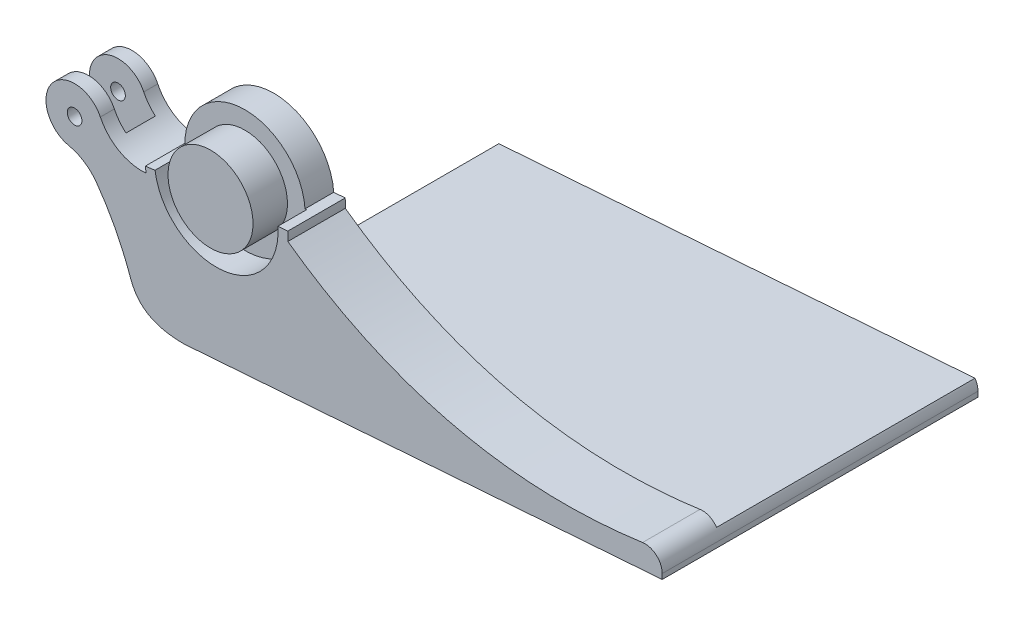
ISO-10303-21;
HEADER;
FILE_DESCRIPTION(('STEP AP214'),'2;1');
FILE_NAME('part.step','',(''),(''),'','','');
FILE_SCHEMA(('AUTOMOTIVE_DESIGN { 1 0 10303 214 1 1 1 1 }'));
ENDSEC;
DATA;
#1=APPLICATION_CONTEXT('core data for automotive mechanical design processes');
#2=APPLICATION_PROTOCOL_DEFINITION('international standard','automotive_design',2000,#1);
#3=PRODUCT_CONTEXT('',#1,'mechanical');
#4=PRODUCT('Part','Part','',(#3));
#5=PRODUCT_RELATED_PRODUCT_CATEGORY('part','',(#4));
#6=PRODUCT_DEFINITION_FORMATION('','',#4);
#7=PRODUCT_DEFINITION_CONTEXT('part definition',#1,'design');
#8=PRODUCT_DEFINITION('design','',#6,#7);
#9=PRODUCT_DEFINITION_SHAPE('','',#8);
#10=(LENGTH_UNIT() NAMED_UNIT(*) SI_UNIT(.MILLI.,.METRE.));
#11=(NAMED_UNIT(*) PLANE_ANGLE_UNIT() SI_UNIT($,.RADIAN.));
#12=(NAMED_UNIT(*) SI_UNIT($,.STERADIAN.) SOLID_ANGLE_UNIT());
#13=UNCERTAINTY_MEASURE_WITH_UNIT(LENGTH_MEASURE(1.E-05),#10,'distance_accuracy_value','');
#14=(GEOMETRIC_REPRESENTATION_CONTEXT(3) GLOBAL_UNCERTAINTY_ASSIGNED_CONTEXT((#13)) GLOBAL_UNIT_ASSIGNED_CONTEXT((#10,
#11,#12)) REPRESENTATION_CONTEXT('',''));
#15=CARTESIAN_POINT('',(0.,0.,0.));
#16=DIRECTION('',(0.,0.,1.));
#17=DIRECTION('',(1.,0.,0.));
#18=AXIS2_PLACEMENT_3D('',#15,#16,#17);
#19=CARTESIAN_POINT('',(-62.6708512351037,-408.288415220356,-61.1876777576715));
#20=DIRECTION('',(0.,0.,1.));
#21=DIRECTION('',(1.,0.,0.));
#22=AXIS2_PLACEMENT_3D('',#19,#20,#21);
#23=CYLINDRICAL_SURFACE('',#22,12.6528548126842);
#24=DIRECTION('',(0.,0.,1.));
#25=VECTOR('',#24,1.);
#26=CARTESIAN_POINT('',(-51.2833585505194,-402.773005419679,-61.1876777576715));
#27=LINE('',#26,#25);
#28=CARTESIAN_POINT('',(-51.2833585505194,-402.773005419679,0.));
#29=VERTEX_POINT('',#28);
#30=CARTESIAN_POINT('',(-51.2833585505194,-402.773005419679,-6.19327650990498));
#31=VERTEX_POINT('',#30);
#32=EDGE_CURVE('E316',#29,#31,#27,.F.);
#33=ORIENTED_EDGE('',*,*,#32,.T.);
#34=CARTESIAN_POINT('',(-62.6708512351037,-408.288415220356,-6.19327650990498));
#35=DIRECTION('',(0.,0.,-1.));
#36=DIRECTION('',(0.,1.,0.));
#37=AXIS2_PLACEMENT_3D('',#34,#35,#36);
#38=CIRCLE('',#37,12.6528548126842);
#39=CARTESIAN_POINT('',(-65.2956830154994,-420.666015675836,-6.19327650990498));
#40=VERTEX_POINT('',#39);
#41=EDGE_CURVE('E227',#31,#40,#38,.F.);
#42=ORIENTED_EDGE('',*,*,#41,.T.);
#43=DIRECTION('',(0.,0.,1.));
#44=VECTOR('',#43,1.);
#45=CARTESIAN_POINT('',(-65.2956830154994,-420.666015675836,-61.1876777576715));
#46=LINE('',#45,#44);
#47=CARTESIAN_POINT('',(-65.2956830154994,-420.666015675836,0.));
#48=VERTEX_POINT('',#47);
#49=EDGE_CURVE('E319',#40,#48,#46,.T.);
#50=ORIENTED_EDGE('',*,*,#49,.T.);
#51=CARTESIAN_POINT('',(-62.6708512351037,-408.288415220356,0.));
#52=DIRECTION('',(0.,0.,1.));
#53=DIRECTION('',(1.,0.,0.));
#54=AXIS2_PLACEMENT_3D('',#51,#52,#53);
#55=CIRCLE('',#54,12.6528548126842);
#56=EDGE_CURVE('E265',#29,#48,#55,.T.);
#57=ORIENTED_EDGE('',*,*,#56,.F.);
#58=EDGE_LOOP('',(#33,#42,#50,#57));
#59=FACE_BOUND('',#58,.T.);
#60=ADVANCED_FACE('F35',(#59),#23,.T.);
#61=CARTESIAN_POINT('',(-65.2956830154994,-420.666015675836,-25.4));
#62=VERTEX_POINT('',#61);
#63=CARTESIAN_POINT('',(-65.2956830154994,-420.666015675836,-19.206723490095));
#64=VERTEX_POINT('',#63);
#65=EDGE_CURVE('E286',#62,#64,#46,.T.);
#66=ORIENTED_EDGE('',*,*,#65,.T.);
#67=CARTESIAN_POINT('',(-62.6708512351037,-408.288415220356,-19.206723490095));
#68=DIRECTION('',(0.,0.,1.));
#69=DIRECTION('',(1.,0.,0.));
#70=AXIS2_PLACEMENT_3D('',#67,#68,#69);
#71=CIRCLE('',#70,12.6528548126842);
#72=CARTESIAN_POINT('',(-51.2833585505194,-402.773005419679,-19.206723490095));
#73=VERTEX_POINT('',#72);
#74=EDGE_CURVE('E214',#64,#73,#71,.F.);
#75=ORIENTED_EDGE('',*,*,#74,.T.);
#76=CARTESIAN_POINT('',(-51.2833585505194,-402.773005419679,-25.4));
#77=VERTEX_POINT('',#76);
#78=EDGE_CURVE('E311',#73,#77,#27,.F.);
#79=ORIENTED_EDGE('',*,*,#78,.T.);
#80=CARTESIAN_POINT('',(-62.6708512351037,-408.288415220356,-25.4));
#81=DIRECTION('',(0.,0.,-1.));
#82=DIRECTION('',(-1.,0.,0.));
#83=AXIS2_PLACEMENT_3D('',#80,#81,#82);
#84=CIRCLE('',#83,12.6528548126842);
#85=EDGE_CURVE('E268',#77,#62,#84,.F.);
#86=ORIENTED_EDGE('',*,*,#85,.T.);
#87=EDGE_LOOP('',(#66,#75,#79,#86));
#88=FACE_BOUND('',#87,.T.);
#89=ADVANCED_FACE('F310',(#88),#23,.T.);
#90=CARTESIAN_POINT('',(-62.6708512351037,-408.288415220356,-25.4000250000001));
#91=DIRECTION('',(0.,0.,1.));
#92=DIRECTION('',(1.,0.,0.));
#93=AXIS2_PLACEMENT_3D('',#90,#91,#92);
#94=CYLINDRICAL_SURFACE('',#93,3.25000000134294);
#95=CARTESIAN_POINT('',(-62.6708512351037,-408.288415220356,0.));
#96=DIRECTION('',(0.,0.,1.));
#97=DIRECTION('',(1.,0.,0.));
#98=AXIS2_PLACEMENT_3D('',#95,#96,#97);
#99=CIRCLE('',#98,3.25000000134294);
#100=CARTESIAN_POINT('',(-59.4208512337607,-408.288415220356,0.));
#101=VERTEX_POINT('',#100);
#102=EDGE_CURVE('E261',#101,#101,#99,.T.);
#103=ORIENTED_EDGE('',*,*,#102,.T.);
#104=EDGE_LOOP('',(#103));
#105=FACE_BOUND('',#104,.T.);
#106=CARTESIAN_POINT('',(-62.6708512351037,-408.288415220356,-6.19327650990498));
#107=DIRECTION('',(0.,0.,-1.));
#108=DIRECTION('',(0.,1.,0.));
#109=AXIS2_PLACEMENT_3D('',#106,#107,#108);
#110=CIRCLE('',#109,3.25000000134294);
#111=CARTESIAN_POINT('',(-62.6708512351037,-405.038415219013,-6.19327650990498));
#112=VERTEX_POINT('',#111);
#113=EDGE_CURVE('E232',#112,#112,#110,.F.);
#114=ORIENTED_EDGE('',*,*,#113,.F.);
#115=EDGE_LOOP('',(#114));
#116=FACE_BOUND('',#115,.T.);
#117=ADVANCED_FACE('F582',(#105,#116),#94,.F.);
#118=CARTESIAN_POINT('',(-62.6708512351037,-408.288415220356,-25.4));
#119=DIRECTION('',(0.,0.,-1.));
#120=DIRECTION('',(-1.,0.,0.));
#121=AXIS2_PLACEMENT_3D('',#118,#119,#120);
#122=CIRCLE('',#121,3.25000000134294);
#123=CARTESIAN_POINT('',(-65.9208512364466,-408.288415220356,-25.4));
#124=VERTEX_POINT('',#123);
#125=EDGE_CURVE('E264',#124,#124,#122,.T.);
#126=ORIENTED_EDGE('',*,*,#125,.T.);
#127=EDGE_LOOP('',(#126));
#128=FACE_BOUND('',#127,.T.);
#129=CARTESIAN_POINT('',(-62.6708512351037,-408.288415220356,-19.206723490095));
#130=DIRECTION('',(0.,0.,1.));
#131=DIRECTION('',(1.,0.,0.));
#132=AXIS2_PLACEMENT_3D('',#129,#130,#131);
#133=CIRCLE('',#132,3.25000000134294);
#134=CARTESIAN_POINT('',(-59.4208512337607,-408.288415220356,-19.206723490095));
#135=VERTEX_POINT('',#134);
#136=EDGE_CURVE('E224',#135,#135,#133,.F.);
#137=ORIENTED_EDGE('',*,*,#136,.F.);
#138=EDGE_LOOP('',(#137));
#139=FACE_BOUND('',#138,.T.);
#140=ADVANCED_FACE('F586',(#128,#139),#94,.F.);
#141=CARTESIAN_POINT('',(-69.5110622771164,-440.543967725298,-12.7));
#142=DIRECTION('',(0.,0.,1.));
#143=DIRECTION('',(1.,0.,0.));
#144=AXIS2_PLACEMENT_3D('',#141,#142,#143);
#145=CYLINDRICAL_SURFACE('',#144,20.32);
#146=CARTESIAN_POINT('',(-69.5110622771164,-440.543967725298,-6.19327650990498));
#147=DIRECTION('',(0.,0.,-1.));
#148=DIRECTION('',(0.,1.,0.));
#149=AXIS2_PLACEMENT_3D('',#146,#147,#148);
#150=CIRCLE('',#149,20.32);
#151=CARTESIAN_POINT('',(-59.137076034932,-423.071623593873,-6.19327650990498));
#152=VERTEX_POINT('',#151);
#153=EDGE_CURVE('E230',#152,#40,#150,.F.);
#154=ORIENTED_EDGE('',*,*,#153,.F.);
#155=DIRECTION('',(0.,0.,1.));
#156=VECTOR('',#155,1.);
#157=CARTESIAN_POINT('',(-59.137076034932,-423.071623593873,-12.7));
#158=LINE('',#157,#156);
#159=CARTESIAN_POINT('',(-59.137076034932,-423.071623593873,-19.206723490095));
#160=VERTEX_POINT('',#159);
#161=EDGE_CURVE('E11',#160,#152,#158,.T.);
#162=ORIENTED_EDGE('',*,*,#161,.F.);
#163=CARTESIAN_POINT('',(-69.5110622771164,-440.543967725298,-19.206723490095));
#164=DIRECTION('',(0.,0.,1.));
#165=DIRECTION('',(1.,0.,0.));
#166=AXIS2_PLACEMENT_3D('',#163,#164,#165);
#167=CIRCLE('',#166,20.32);
#168=EDGE_CURVE('E218',#64,#160,#167,.F.);
#169=ORIENTED_EDGE('',*,*,#168,.F.);
#170=ORIENTED_EDGE('',*,*,#65,.F.);
#171=CARTESIAN_POINT('',(-69.5110622771164,-440.543967725298,-25.4));
#172=DIRECTION('',(0.,0.,-1.));
#173=DIRECTION('',(-1.,0.,0.));
#174=AXIS2_PLACEMENT_3D('',#171,#172,#173);
#175=CIRCLE('',#174,20.32);
#176=CARTESIAN_POINT('',(-53.0342644858855,-428.652057258646,-25.4));
#177=VERTEX_POINT('',#176);
#178=EDGE_CURVE('E292',#177,#62,#175,.F.);
#179=ORIENTED_EDGE('',*,*,#178,.F.);
#180=DIRECTION('',(0.,0.,1.));
#181=VECTOR('',#180,1.);
#182=CARTESIAN_POINT('',(-53.0342644858856,-428.652057258646,0.));
#183=LINE('',#182,#181);
#184=CARTESIAN_POINT('',(-53.0342644858856,-428.652057258646,0.));
#185=VERTEX_POINT('',#184);
#186=EDGE_CURVE('E288',#185,#177,#183,.F.);
#187=ORIENTED_EDGE('',*,*,#186,.F.);
#188=CARTESIAN_POINT('',(-69.5110622771164,-440.543967725298,0.));
#189=DIRECTION('',(0.,0.,1.));
#190=DIRECTION('',(1.,0.,0.));
#191=AXIS2_PLACEMENT_3D('',#188,#189,#190);
#192=CIRCLE('',#191,20.32);
#193=EDGE_CURVE('E290',#48,#185,#192,.F.);
#194=ORIENTED_EDGE('',*,*,#193,.F.);
#195=ORIENTED_EDGE('',*,*,#49,.F.);
#196=EDGE_LOOP('',(#154,#162,#169,#170,#179,#187,#194,#195));
#197=FACE_BOUND('',#196,.T.);
#198=ADVANCED_FACE('F520',(#197),#145,.F.);
#199=CARTESIAN_POINT('',(-32.9954816423939,-393.915468617992,-12.7));
#200=DIRECTION('',(0.,0.,1.));
#201=DIRECTION('',(1.,0.,0.));
#202=AXIS2_PLACEMENT_3D('',#199,#200,#201);
#203=CYLINDRICAL_SURFACE('',#202,20.32);
#204=CARTESIAN_POINT('',(-32.9954816423939,-393.915468617992,-6.19327650990498));
#205=DIRECTION('',(0.,0.,-1.));
#206=DIRECTION('',(0.,1.,0.));
#207=AXIS2_PLACEMENT_3D('',#204,#205,#206);
#208=CIRCLE('',#207,20.32);
#209=CARTESIAN_POINT('',(-46.1342496053724,-409.416280739136,-6.19327650990498));
#210=VERTEX_POINT('',#209);
#211=EDGE_CURVE('E43',#31,#210,#208,.F.);
#212=ORIENTED_EDGE('',*,*,#211,.F.);
#213=ORIENTED_EDGE('',*,*,#32,.F.);
#214=CARTESIAN_POINT('',(-32.9954816423939,-393.915468617992,0.));
#215=DIRECTION('',(0.,0.,1.));
#216=DIRECTION('',(1.,0.,0.));
#217=AXIS2_PLACEMENT_3D('',#214,#215,#216);
#218=CIRCLE('',#217,20.32);
#219=CARTESIAN_POINT('',(-30.9682303902719,-414.134090043815,0.));
#220=VERTEX_POINT('',#219);
#221=EDGE_CURVE('E296',#220,#29,#218,.F.);
#222=ORIENTED_EDGE('',*,*,#221,.F.);
#223=DIRECTION('',(0.,0.,-1.));
#224=VECTOR('',#223,1.);
#225=CARTESIAN_POINT('',(-30.9682303902719,-414.134090043815,-12.7));
#226=LINE('',#225,#224);
#227=CARTESIAN_POINT('',(-30.9682303902719,-414.134090043815,-25.4));
#228=VERTEX_POINT('',#227);
#229=EDGE_CURVE('E400',#220,#228,#226,.T.);
#230=ORIENTED_EDGE('',*,*,#229,.T.);
#231=CARTESIAN_POINT('',(-32.9954816423939,-393.915468617992,-25.4));
#232=DIRECTION('',(0.,0.,-1.));
#233=DIRECTION('',(-1.,0.,0.));
#234=AXIS2_PLACEMENT_3D('',#231,#232,#233);
#235=CIRCLE('',#234,20.32);
#236=EDGE_CURVE('E294',#77,#228,#235,.F.);
#237=ORIENTED_EDGE('',*,*,#236,.F.);
#238=ORIENTED_EDGE('',*,*,#78,.F.);
#239=CARTESIAN_POINT('',(-32.9954816423939,-393.915468617992,-19.206723490095));
#240=DIRECTION('',(0.,0.,1.));
#241=DIRECTION('',(1.,0.,0.));
#242=AXIS2_PLACEMENT_3D('',#239,#240,#241);
#243=CIRCLE('',#242,20.32);
#244=CARTESIAN_POINT('',(-46.1342496053724,-409.416280739136,-19.206723490095));
#245=VERTEX_POINT('',#244);
#246=EDGE_CURVE('E300',#245,#73,#243,.F.);
#247=ORIENTED_EDGE('',*,*,#246,.F.);
#248=DIRECTION('',(0.,0.,1.));
#249=VECTOR('',#248,1.);
#250=CARTESIAN_POINT('',(-46.1342496053724,-409.416280739136,-12.7));
#251=LINE('',#250,#249);
#252=EDGE_CURVE('E298',#210,#245,#251,.F.);
#253=ORIENTED_EDGE('',*,*,#252,.F.);
#254=EDGE_LOOP('',(#212,#213,#222,#230,#237,#238,#247,#253));
#255=FACE_BOUND('',#254,.T.);
#256=ADVANCED_FACE('F37',(#255),#203,.F.);
#257=CARTESIAN_POINT('',(-14.2133467217654,-471.208070579211,-12.7));
#258=CARTESIAN_POINT('',(-31.6860440554397,-471.208070579211,-12.7));
#259=CARTESIAN_POINT('',(-38.6391749384221,-461.093724089523,-12.7));
#260=CARTESIAN_POINT('',(-41.0401094992883,-436.729451804708,-12.7));
#261=CARTESIAN_POINT('',(-32.6499491240898,-424.47070153133,-12.7));
#262=CARTESIAN_POINT('',(-30.9682303902719,-414.134090043815,-12.7));
#263=B_SPLINE_CURVE_WITH_KNOTS('',3,(#257,#258,#259,#260,#261,#262),.UNSPECIFIED.,.F.,.F.,(4,1,
1,4),(0.,0.42712160549341,0.556252195251656,1.),.UNSPECIFIED.);
#264=DIRECTION('',(0.,0.,-1.));
#265=VECTOR('',#264,1.);
#266=SURFACE_OF_LINEAR_EXTRUSION('',#263,#265);
#267=CARTESIAN_POINT('',(-30.9682303902719,-414.134090043815,0.));
#268=CARTESIAN_POINT('',(-32.6499491240898,-424.47070153133,0.));
#269=CARTESIAN_POINT('',(-41.0401094992883,-436.729451804708,0.));
#270=CARTESIAN_POINT('',(-38.6391749384221,-461.093724089523,0.));
#271=CARTESIAN_POINT('',(-31.6860440554397,-471.208070579211,0.));
#272=CARTESIAN_POINT('',(-14.2133467217654,-471.208070579211,0.));
#273=B_SPLINE_CURVE_WITH_KNOTS('',3,(#267,#268,#269,#270,#271,#272),.UNSPECIFIED.,.F.,.F.,(4,1,
1,4),(0.,0.443747804748344,0.57287839450659,1.),.UNSPECIFIED.);
#274=CARTESIAN_POINT('',(-37.899374687678,-457.862620822938,0.));
#275=VERTEX_POINT('',#274);
#276=CARTESIAN_POINT('',(-14.2133467217654,-471.208070579211,0.));
#277=VERTEX_POINT('',#276);
#278=EDGE_CURVE('E443',#275,#277,#273,.T.);
#279=ORIENTED_EDGE('',*,*,#278,.F.);
#280=DIRECTION('',(0.,0.,1.));
#281=VECTOR('',#280,1.);
#282=CARTESIAN_POINT('',(-37.8993746824244,-457.862620837788,-93.0023164333482));
#283=LINE('',#282,#281);
#284=CARTESIAN_POINT('',(-37.899374687678,-457.862620822938,-25.4));
#285=VERTEX_POINT('',#284);
#286=EDGE_CURVE('E446',#285,#275,#283,.T.);
#287=ORIENTED_EDGE('',*,*,#286,.F.);
#288=CARTESIAN_POINT('',(-14.2133467217654,-471.208070579211,-25.4));
#289=CARTESIAN_POINT('',(-31.6860440554397,-471.208070579211,-25.4));
#290=CARTESIAN_POINT('',(-38.6391749384221,-461.093724089523,-25.4));
#291=CARTESIAN_POINT('',(-41.0401094992883,-436.729451804708,-25.4));
#292=CARTESIAN_POINT('',(-32.6499491240898,-424.47070153133,-25.4));
#293=CARTESIAN_POINT('',(-30.9682303902719,-414.134090043815,-25.4));
#294=B_SPLINE_CURVE_WITH_KNOTS('',3,(#288,#289,#290,#291,#292,#293),.UNSPECIFIED.,.F.,.F.,(4,1,
1,4),(0.,0.42712160549341,0.556252195251656,1.),.UNSPECIFIED.);
#295=CARTESIAN_POINT('',(-14.2133467217654,-471.208070579211,-25.4));
#296=VERTEX_POINT('',#295);
#297=EDGE_CURVE('E380',#296,#285,#294,.T.);
#298=ORIENTED_EDGE('',*,*,#297,.F.);
#299=DIRECTION('',(0.,0.,-1.));
#300=VECTOR('',#299,1.);
#301=CARTESIAN_POINT('',(-14.2133467217654,-471.208070579211,-12.7));
#302=LINE('',#301,#300);
#303=EDGE_CURVE('E401',#277,#296,#302,.T.);
#304=ORIENTED_EDGE('',*,*,#303,.F.);
#305=EDGE_LOOP('',(#279,#287,#298,#304));
#306=FACE_BOUND('',#305,.T.);
#307=ADVANCED_FACE('F369',(#306),#266,.T.);
#308=CARTESIAN_POINT('',(0.,-407.299625140818,-12.7));
#309=DIRECTION('',(0.,0.,1.));
#310=DIRECTION('',(1.,0.,0.));
#311=AXIS2_PLACEMENT_3D('',#308,#309,#310);
#312=CYLINDRICAL_SURFACE('',#311,18.796);
#313=CARTESIAN_POINT('',(0.,-407.299625140818,2.54));
#314=DIRECTION('',(0.,0.,1.));
#315=DIRECTION('',(1.,0.,0.));
#316=AXIS2_PLACEMENT_3D('',#313,#314,#315);
#317=CIRCLE('',#316,18.796);
#318=CARTESIAN_POINT('',(18.796,-407.299625140818,2.54));
#319=VERTEX_POINT('',#318);
#320=EDGE_CURVE('E317',#319,#319,#317,.T.);
#321=ORIENTED_EDGE('',*,*,#320,.F.);
#322=EDGE_LOOP('',(#321));
#323=FACE_BOUND('',#322,.T.);
#324=CARTESIAN_POINT('',(0.,-407.299625140818,-12.7));
#325=DIRECTION('',(0.,0.,-1.));
#326=DIRECTION('',(-1.,0.,0.));
#327=AXIS2_PLACEMENT_3D('',#324,#325,#326);
#328=CIRCLE('',#327,18.796);
#329=CARTESIAN_POINT('',(-18.7959999999999,-407.299625140818,-12.7));
#330=VERTEX_POINT('',#329);
#331=EDGE_CURVE('E404',#330,#330,#328,.T.);
#332=ORIENTED_EDGE('',*,*,#331,.F.);
#333=EDGE_LOOP('',(#332));
#334=FACE_BOUND('',#333,.T.);
#335=ADVANCED_FACE('F707',(#323,#334),#312,.T.);
#336=CARTESIAN_POINT('',(0.,-407.299625140818,2.54));
#337=DIRECTION('',(0.,0.,1.));
#338=DIRECTION('',(1.,0.,0.));
#339=AXIS2_PLACEMENT_3D('',#336,#337,#338);
#340=PLANE('',#339);
#341=ORIENTED_EDGE('',*,*,#320,.T.);
#342=EDGE_LOOP('',(#341));
#343=FACE_BOUND('',#342,.T.);
#344=ADVANCED_FACE('F712',(#343),#340,.T.);
#345=CARTESIAN_POINT('',(0.,-407.299625140818,-25.4));
#346=DIRECTION('',(0.,0.,1.));
#347=DIRECTION('',(1.,0.,0.));
#348=AXIS2_PLACEMENT_3D('',#345,#346,#347);
#349=CYLINDRICAL_SURFACE('',#348,31.713423088895);
#350=ORIENTED_EDGE('',*,*,#229,.F.);
#351=CARTESIAN_POINT('',(0.,-407.299625140819,0.));
#352=DIRECTION('',(0.,0.,1.));
#353=DIRECTION('',(1.,0.,0.));
#354=AXIS2_PLACEMENT_3D('',#351,#352,#353);
#355=CIRCLE('',#354,31.713423088895);
#356=CARTESIAN_POINT('',(-31.4141879576614,-411.645887785434,0.));
#357=VERTEX_POINT('',#356);
#358=EDGE_CURVE('E472',#357,#220,#355,.T.);
#359=ORIENTED_EDGE('',*,*,#358,.F.);
#360=DIRECTION('',(0.,0.,1.));
#361=VECTOR('',#360,1.);
#362=CARTESIAN_POINT('',(-31.4141879576614,-411.645887785434,-25.4));
#363=LINE('',#362,#361);
#364=CARTESIAN_POINT('',(-31.4141879576614,-411.645887785434,-25.4));
#365=VERTEX_POINT('',#364);
#366=EDGE_CURVE('E427',#365,#357,#363,.T.);
#367=ORIENTED_EDGE('',*,*,#366,.F.);
#368=CARTESIAN_POINT('',(0.,-407.299625140818,-25.4));
#369=DIRECTION('',(0.,0.,-1.));
#370=DIRECTION('',(-1.,0.,0.));
#371=AXIS2_PLACEMENT_3D('',#368,#369,#370);
#372=CIRCLE('',#371,31.713423088895);
#373=EDGE_CURVE('E423',#228,#365,#372,.T.);
#374=ORIENTED_EDGE('',*,*,#373,.F.);
#375=EDGE_LOOP('',(#350,#359,#367,#374));
#376=FACE_BOUND('',#375,.T.);
#377=ADVANCED_FACE('F511',(#376),#349,.T.);
#378=CARTESIAN_POINT('',(31.6687220493051,-408.982850550301,0.));
#379=VERTEX_POINT('',#378);
#380=CARTESIAN_POINT('',(31.6309358195827,-405.013776678495,0.));
#381=VERTEX_POINT('',#380);
#382=EDGE_CURVE('E479',#379,#381,#355,.T.);
#383=ORIENTED_EDGE('',*,*,#382,.F.);
#384=DIRECTION('',(0.,0.,-1.));
#385=VECTOR('',#384,1.);
#386=CARTESIAN_POINT('',(31.668722049305,-408.982850550301,-12.7));
#387=LINE('',#386,#385);
#388=CARTESIAN_POINT('',(31.668722049305,-408.982850550301,-25.4));
#389=VERTEX_POINT('',#388);
#390=EDGE_CURVE('E411',#379,#389,#387,.T.);
#391=ORIENTED_EDGE('',*,*,#390,.T.);
#392=CARTESIAN_POINT('',(31.6309358195827,-405.013776678495,-25.4));
#393=VERTEX_POINT('',#392);
#394=EDGE_CURVE('E424',#393,#389,#372,.T.);
#395=ORIENTED_EDGE('',*,*,#394,.F.);
#396=DIRECTION('',(0.,0.,1.));
#397=VECTOR('',#396,1.);
#398=CARTESIAN_POINT('',(31.6309358195827,-405.013776678495,-25.4));
#399=LINE('',#398,#397);
#400=EDGE_CURVE('E437',#393,#381,#399,.T.);
#401=ORIENTED_EDGE('',*,*,#400,.T.);
#402=EDGE_LOOP('',(#383,#391,#395,#401));
#403=FACE_BOUND('',#402,.T.);
#404=ADVANCED_FACE('F566',(#403),#349,.T.);
#405=CARTESIAN_POINT('',(0.,0.,-12.7));
#406=DIRECTION('',(0.,0.,-1.));
#407=DIRECTION('',(-1.,0.,0.));
#408=AXIS2_PLACEMENT_3D('',#405,#406,#407);
#409=PLANE('',#408);
#410=ORIENTED_EDGE('',*,*,#331,.T.);
#411=EDGE_LOOP('',(#410));
#412=FACE_BOUND('',#411,.T.);
#413=CARTESIAN_POINT('',(0.,-407.299625140819,-12.7));
#414=DIRECTION('',(0.,0.,-1.));
#415=DIRECTION('',(1.,0.,0.));
#416=AXIS2_PLACEMENT_3D('',#413,#414,#415);
#417=CIRCLE('',#416,27.3500674545047);
#418=CARTESIAN_POINT('',(27.278929363435,-405.328279775165,-12.7));
#419=VERTEX_POINT('',#418);
#420=CARTESIAN_POINT('',(-27.0920031956873,-411.047898424722,-12.7));
#421=VERTEX_POINT('',#420);
#422=EDGE_CURVE('E471',#419,#421,#417,.T.);
#423=ORIENTED_EDGE('',*,*,#422,.F.);
#424=DIRECTION('',(-0.997398979319225,-0.0720782633875782,0.));
#425=VECTOR('',#424,1.);
#426=CARTESIAN_POINT('',(29.281090324865,-405.183591151941,-12.7));
#427=LINE('',#426,#425);
#428=CARTESIAN_POINT('',(26.564149004641,-405.379934256504,-12.7));
#429=VERTEX_POINT('',#428);
#430=EDGE_CURVE('E418',#419,#429,#427,.T.);
#431=ORIENTED_EDGE('',*,*,#430,.T.);
#432=CARTESIAN_POINT('',(0.,-407.299625140818,-12.7));
#433=DIRECTION('',(0.,0.,-1.));
#434=DIRECTION('',(-1.,0.,0.));
#435=AXIS2_PLACEMENT_3D('',#432,#433,#434);
#436=CIRCLE('',#435,26.633423088895);
#437=CARTESIAN_POINT('',(-26.382120798667,-410.949683715228,-12.7));
#438=VERTEX_POINT('',#437);
#439=EDGE_CURVE('E432',#438,#429,#436,.T.);
#440=ORIENTED_EDGE('',*,*,#439,.F.);
#441=DIRECTION('',(-0.990564401376829,-0.137048045316106,0.));
#442=VECTOR('',#441,1.);
#443=CARTESIAN_POINT('',(55.2929259776582,-399.649655674407,-12.7));
#444=LINE('',#443,#442);
#445=EDGE_CURVE('E430',#438,#421,#444,.T.);
#446=ORIENTED_EDGE('',*,*,#445,.T.);
#447=EDGE_LOOP('',(#423,#431,#440,#446));
#448=FACE_BOUND('',#447,.T.);
#449=ADVANCED_FACE('F500',(#412,#448),#409,.F.);
#450=CARTESIAN_POINT('',(55.2929259776582,-399.649655674407,-25.4));
#451=DIRECTION('',(-0.137048045316106,0.990564401376829,0.));
#452=DIRECTION('',(-0.990564401376829,-0.137048045316106,0.));
#453=AXIS2_PLACEMENT_3D('',#450,#451,#452);
#454=PLANE('',#453);
#455=ORIENTED_EDGE('',*,*,#445,.F.);
#456=DIRECTION('',(0.,0.,1.));
#457=VECTOR('',#456,1.);
#458=CARTESIAN_POINT('',(-26.382120798667,-410.949683715228,-25.4));
#459=LINE('',#458,#457);
#460=CARTESIAN_POINT('',(-26.382120798667,-410.949683715228,-25.4));
#461=VERTEX_POINT('',#460);
#462=EDGE_CURVE('E321',#461,#438,#459,.T.);
#463=ORIENTED_EDGE('',*,*,#462,.F.);
#464=DIRECTION('',(-0.990564401376829,-0.137048045316106,0.));
#465=VECTOR('',#464,1.);
#466=CARTESIAN_POINT('',(55.2929259776582,-399.649655674407,-25.4));
#467=LINE('',#466,#465);
#468=EDGE_CURVE('E414',#461,#365,#467,.T.);
#469=ORIENTED_EDGE('',*,*,#468,.T.);
#470=ORIENTED_EDGE('',*,*,#366,.T.);
#471=DIRECTION('',(-0.990564401376829,-0.137048045316103,0.));
#472=VECTOR('',#471,1.);
#473=CARTESIAN_POINT('',(-27.0920031956873,-411.047898424722,0.));
#474=LINE('',#473,#472);
#475=CARTESIAN_POINT('',(-27.0920031956873,-411.047898424722,0.));
#476=VERTEX_POINT('',#475);
#477=EDGE_CURVE('E483',#476,#357,#474,.T.);
#478=ORIENTED_EDGE('',*,*,#477,.F.);
#479=DIRECTION('',(0.,0.,-1.));
#480=VECTOR('',#479,1.);
#481=CARTESIAN_POINT('',(-27.0920031956873,-411.047898424722,0.));
#482=LINE('',#481,#480);
#483=EDGE_CURVE('E486',#476,#421,#482,.T.);
#484=ORIENTED_EDGE('',*,*,#483,.T.);
#485=EDGE_LOOP('',(#455,#463,#469,#470,#478,#484));
#486=FACE_BOUND('',#485,.T.);
#487=ADVANCED_FACE('F503',(#486),#454,.T.);
#488=CARTESIAN_POINT('',(0.,-407.299625140818,-25.4));
#489=DIRECTION('',(0.,0.,1.));
#490=DIRECTION('',(1.,0.,0.));
#491=AXIS2_PLACEMENT_3D('',#488,#489,#490);
#492=CYLINDRICAL_SURFACE('',#491,26.633423088895);
#493=ORIENTED_EDGE('',*,*,#439,.T.);
#494=DIRECTION('',(0.,0.,1.));
#495=VECTOR('',#494,1.);
#496=CARTESIAN_POINT('',(26.564149004641,-405.379934256504,-25.4));
#497=LINE('',#496,#495);
#498=CARTESIAN_POINT('',(26.564149004641,-405.379934256504,-25.4));
#499=VERTEX_POINT('',#498);
#500=EDGE_CURVE('E440',#499,#429,#497,.T.);
#501=ORIENTED_EDGE('',*,*,#500,.F.);
#502=CARTESIAN_POINT('',(0.,-407.299625140818,-25.4));
#503=DIRECTION('',(0.,0.,-1.));
#504=DIRECTION('',(-1.,0.,0.));
#505=AXIS2_PLACEMENT_3D('',#502,#503,#504);
#506=CIRCLE('',#505,26.633423088895);
#507=EDGE_CURVE('E417',#461,#499,#506,.T.);
#508=ORIENTED_EDGE('',*,*,#507,.F.);
#509=ORIENTED_EDGE('',*,*,#462,.T.);
#510=EDGE_LOOP('',(#493,#501,#508,#509));
#511=FACE_BOUND('',#510,.T.);
#512=ADVANCED_FACE('F569',(#511),#492,.T.);
#513=CARTESIAN_POINT('',(29.281090324865,-405.183591151941,-25.4));
#514=DIRECTION('',(-0.0720782633875782,0.997398979319224,0.));
#515=DIRECTION('',(-0.997398979319225,-0.0720782633875782,0.));
#516=AXIS2_PLACEMENT_3D('',#513,#514,#515);
#517=PLANE('',#516);
#518=ORIENTED_EDGE('',*,*,#430,.F.);
#519=DIRECTION('',(0.,0.,-1.));
#520=VECTOR('',#519,1.);
#521=CARTESIAN_POINT('',(27.278929363435,-405.328279775165,0.));
#522=LINE('',#521,#520);
#523=CARTESIAN_POINT('',(27.278929363435,-405.328279775165,0.));
#524=VERTEX_POINT('',#523);
#525=EDGE_CURVE('E389',#524,#419,#522,.T.);
#526=ORIENTED_EDGE('',*,*,#525,.F.);
#527=DIRECTION('',(-0.997398979319225,-0.0720782633875756,0.));
#528=VECTOR('',#527,1.);
#529=CARTESIAN_POINT('',(31.6309358195827,-405.013776678495,0.));
#530=LINE('',#529,#528);
#531=EDGE_CURVE('E478',#381,#524,#530,.T.);
#532=ORIENTED_EDGE('',*,*,#531,.F.);
#533=ORIENTED_EDGE('',*,*,#400,.F.);
#534=DIRECTION('',(-0.997398979319225,-0.0720782633875782,0.));
#535=VECTOR('',#534,1.);
#536=CARTESIAN_POINT('',(29.281090324865,-405.183591151941,-25.4));
#537=LINE('',#536,#535);
#538=EDGE_CURVE('E420',#393,#499,#537,.T.);
#539=ORIENTED_EDGE('',*,*,#538,.T.);
#540=ORIENTED_EDGE('',*,*,#500,.T.);
#541=EDGE_LOOP('',(#518,#526,#532,#533,#539,#540));
#542=FACE_BOUND('',#541,.T.);
#543=ADVANCED_FACE('F356',(#542),#517,.T.);
#544=CARTESIAN_POINT('',(-14.2133467217654,-471.208070579211,-12.7));
#545=DIRECTION('',(0.0732481759295867,-0.997313744376858,0.));
#546=DIRECTION('',(0.997313744376858,0.0732481759295867,0.));
#547=AXIS2_PLACEMENT_3D('',#544,#545,#546);
#548=PLANE('',#547);
#549=ORIENTED_EDGE('',*,*,#303,.T.);
#550=DIRECTION('',(0.,0.,1.));
#551=VECTOR('',#550,1.);
#552=CARTESIAN_POINT('',(-14.2133467217654,-471.208070579211,-139.7));
#553=LINE('',#552,#551);
#554=CARTESIAN_POINT('',(-14.2133467217654,-471.208070579211,-139.7));
#555=VERTEX_POINT('',#554);
#556=EDGE_CURVE('E258',#555,#296,#553,.T.);
#557=ORIENTED_EDGE('',*,*,#556,.F.);
#558=DIRECTION('',(-0.997313744376858,-0.0732481759295867,0.));
#559=VECTOR('',#558,1.);
#560=CARTESIAN_POINT('',(197.266538305095,-455.675831189795,-139.7));
#561=LINE('',#560,#559);
#562=CARTESIAN_POINT('',(197.266538305095,-455.675831189795,-139.7));
#563=VERTEX_POINT('',#562);
#564=EDGE_CURVE('E239',#563,#555,#561,.T.);
#565=ORIENTED_EDGE('',*,*,#564,.F.);
#566=DIRECTION('',(0.,0.,-1.));
#567=VECTOR('',#566,1.);
#568=CARTESIAN_POINT('',(197.266538305095,-455.675831189795,-12.7));
#569=LINE('',#568,#567);
#570=CARTESIAN_POINT('',(197.266538305095,-455.675831189795,0.));
#571=VERTEX_POINT('',#570);
#572=EDGE_CURVE('E405',#571,#563,#569,.T.);
#573=ORIENTED_EDGE('',*,*,#572,.F.);
#574=DIRECTION('',(0.997313744376858,0.0732481759295867,0.));
#575=VECTOR('',#574,1.);
#576=CARTESIAN_POINT('',(-14.2133467217654,-471.208070579211,0.));
#577=LINE('',#576,#575);
#578=EDGE_CURVE('E454',#277,#571,#577,.T.);
#579=ORIENTED_EDGE('',*,*,#578,.F.);
#580=EDGE_LOOP('',(#549,#557,#565,#573,#579));
#581=FACE_BOUND('',#580,.T.);
#582=ADVANCED_FACE('F352',(#581),#548,.T.);
#583=CARTESIAN_POINT('',(197.266538305095,-453.387916788257,-12.7));
#584=DIRECTION('',(1.,0.,0.));
#585=DIRECTION('',(0.,0.,-1.));
#586=AXIS2_PLACEMENT_3D('',#583,#584,#585);
#587=PLANE('',#586);
#588=ORIENTED_EDGE('',*,*,#572,.T.);
#589=DIRECTION('',(0.,-1.,0.));
#590=VECTOR('',#589,1.);
#591=CARTESIAN_POINT('',(197.266538305095,-453.387916788257,-139.7));
#592=LINE('',#591,#590);
#593=CARTESIAN_POINT('',(197.266538305095,-453.387916788257,-139.7));
#594=VERTEX_POINT('',#593);
#595=EDGE_CURVE('E236',#594,#563,#592,.T.);
#596=ORIENTED_EDGE('',*,*,#595,.F.);
#597=DIRECTION('',(0.,0.,-1.));
#598=VECTOR('',#597,1.);
#599=CARTESIAN_POINT('',(197.266538305095,-453.387916788257,-12.7));
#600=LINE('',#599,#598);
#601=CARTESIAN_POINT('',(197.266538305095,-453.387916788257,0.));
#602=VERTEX_POINT('',#601);
#603=EDGE_CURVE('E407',#602,#594,#600,.T.);
#604=ORIENTED_EDGE('',*,*,#603,.F.);
#605=DIRECTION('',(0.,1.,0.));
#606=VECTOR('',#605,1.);
#607=CARTESIAN_POINT('',(197.266538305095,-455.675831189795,0.));
#608=LINE('',#607,#606);
#609=EDGE_CURVE('E460',#571,#602,#608,.T.);
#610=ORIENTED_EDGE('',*,*,#609,.F.);
#611=EDGE_LOOP('',(#588,#596,#604,#610));
#612=FACE_BOUND('',#611,.T.);
#613=ADVANCED_FACE('F355',(#612),#587,.T.);
#614=CARTESIAN_POINT('',(189.646538305095,-453.387916788257,-12.7));
#615=DIRECTION('',(0.,0.,-1.));
#616=DIRECTION('',(-1.,0.,0.));
#617=AXIS2_PLACEMENT_3D('',#614,#615,#616);
#618=CYLINDRICAL_SURFACE('',#617,7.61999999999999);
#619=CARTESIAN_POINT('',(189.646538305095,-453.387916788257,-25.4));
#620=DIRECTION('',(0.,0.,-1.));
#621=DIRECTION('',(1.,0.,0.));
#622=AXIS2_PLACEMENT_3D('',#619,#620,#621);
#623=CIRCLE('',#622,7.61999999999999);
#624=CARTESIAN_POINT('',(188.586186841651,-445.842053366887,-25.4));
#625=VERTEX_POINT('',#624);
#626=CARTESIAN_POINT('',(195.926737542418,-449.072421736756,-25.4));
#627=VERTEX_POINT('',#626);
#628=EDGE_CURVE('E58',#625,#627,#623,.T.);
#629=ORIENTED_EDGE('',*,*,#628,.F.);
#630=DIRECTION('',(0.,0.,-1.));
#631=VECTOR('',#630,1.);
#632=CARTESIAN_POINT('',(188.586186841651,-445.842053366887,-12.7));
#633=LINE('',#632,#631);
#634=CARTESIAN_POINT('',(188.586186841651,-445.842053366887,0.));
#635=VERTEX_POINT('',#634);
#636=EDGE_CURVE('E409',#635,#625,#633,.T.);
#637=ORIENTED_EDGE('',*,*,#636,.F.);
#638=CARTESIAN_POINT('',(189.646538305095,-453.387916788257,0.));
#639=DIRECTION('',(0.,0.,1.));
#640=DIRECTION('',(1.,0.,0.));
#641=AXIS2_PLACEMENT_3D('',#638,#639,#640);
#642=CIRCLE('',#641,7.61999999999999);
#643=EDGE_CURVE('E463',#602,#635,#642,.T.);
#644=ORIENTED_EDGE('',*,*,#643,.F.);
#645=ORIENTED_EDGE('',*,*,#603,.T.);
#646=CARTESIAN_POINT('',(189.646538305095,-453.387916788257,-139.7));
#647=DIRECTION('',(0.,0.,-1.));
#648=DIRECTION('',(-1.,0.,0.));
#649=AXIS2_PLACEMENT_3D('',#646,#647,#648);
#650=CIRCLE('',#649,7.62);
#651=CARTESIAN_POINT('',(195.926737542418,-449.072421736756,-139.7));
#652=VERTEX_POINT('',#651);
#653=EDGE_CURVE('E246',#652,#594,#650,.T.);
#654=ORIENTED_EDGE('',*,*,#653,.F.);
#655=DIRECTION('',(0.,0.,1.));
#656=VECTOR('',#655,1.);
#657=CARTESIAN_POINT('',(195.926737542418,-449.072421736756,-139.7));
#658=LINE('',#657,#656);
#659=EDGE_CURVE('E249',#652,#627,#658,.T.);
#660=ORIENTED_EDGE('',*,*,#659,.T.);
#661=EDGE_LOOP('',(#629,#637,#644,#645,#654,#660));
#662=FACE_BOUND('',#661,.T.);
#663=ADVANCED_FACE('F360',(#662),#618,.T.);
#664=CARTESIAN_POINT('',(31.668722049305,-408.982850550301,-12.7));
#665=CARTESIAN_POINT('',(77.2098589467567,-441.706865094217,-12.7));
#666=CARTESIAN_POINT('',(129.780268895102,-454.105513447174,-12.7));
#667=CARTESIAN_POINT('',(188.586186841651,-445.842053366887,-12.7));
#668=B_SPLINE_CURVE_WITH_KNOTS('',3,(#664,#665,#666,#667),.UNSPECIFIED.,.F.,.F.,(4,4),(0.,
0.95334459337375),.UNSPECIFIED.);
#669=DIRECTION('',(0.,0.,-1.));
#670=VECTOR('',#669,1.);
#671=SURFACE_OF_LINEAR_EXTRUSION('',#668,#670);
#672=CARTESIAN_POINT('',(31.668722049305,-408.982850550301,-25.4));
#673=CARTESIAN_POINT('',(77.2098589467567,-441.706865094217,-25.4));
#674=CARTESIAN_POINT('',(129.780268895102,-454.105513447174,-25.4));
#675=CARTESIAN_POINT('',(188.586186841651,-445.842053366887,-25.4));
#676=B_SPLINE_CURVE_WITH_KNOTS('',3,(#672,#673,#674,#675),.UNSPECIFIED.,.F.,.F.,(4,4),(0.,
0.95334459337375),.UNSPECIFIED.);
#677=EDGE_CURVE('E388',#389,#625,#676,.T.);
#678=ORIENTED_EDGE('',*,*,#677,.F.);
#679=ORIENTED_EDGE('',*,*,#390,.F.);
#680=CARTESIAN_POINT('',(188.586186841651,-445.842053366887,0.));
#681=CARTESIAN_POINT('',(129.780268895102,-454.105513447174,0.));
#682=CARTESIAN_POINT('',(77.2098589467567,-441.706865094217,0.));
#683=CARTESIAN_POINT('',(31.668722049305,-408.982850550301,0.));
#684=B_SPLINE_CURVE_WITH_KNOTS('',3,(#680,#681,#682,#683),.UNSPECIFIED.,.F.,.F.,(4,4),(0.,
0.95334459337375),.UNSPECIFIED.);
#685=EDGE_CURVE('E466',#635,#379,#684,.T.);
#686=ORIENTED_EDGE('',*,*,#685,.F.);
#687=ORIENTED_EDGE('',*,*,#636,.T.);
#688=EDGE_LOOP('',(#678,#679,#686,#687));
#689=FACE_BOUND('',#688,.T.);
#690=ADVANCED_FACE('F350',(#689),#671,.T.);
#691=CARTESIAN_POINT('',(0.,-407.299625140819,0.));
#692=DIRECTION('',(0.,0.,-1.));
#693=DIRECTION('',(-1.,0.,0.));
#694=AXIS2_PLACEMENT_3D('',#691,#692,#693);
#695=CYLINDRICAL_SURFACE('',#694,27.3500674545047);
#696=ORIENTED_EDGE('',*,*,#422,.T.);
#697=ORIENTED_EDGE('',*,*,#483,.F.);
#698=CARTESIAN_POINT('',(0.,-407.299625140819,0.));
#699=DIRECTION('',(0.,0.,-1.));
#700=DIRECTION('',(1.,0.,0.));
#701=AXIS2_PLACEMENT_3D('',#698,#699,#700);
#702=CIRCLE('',#701,27.3500674545047);
#703=EDGE_CURVE('E481',#524,#476,#702,.T.);
#704=ORIENTED_EDGE('',*,*,#703,.F.);
#705=ORIENTED_EDGE('',*,*,#525,.T.);
#706=EDGE_LOOP('',(#696,#697,#704,#705));
#707=FACE_BOUND('',#706,.T.);
#708=ADVANCED_FACE('F343',(#707),#695,.F.);
#709=CARTESIAN_POINT('',(0.,-407.299625140819,0.));
#710=DIRECTION('',(0.,0.,1.));
#711=DIRECTION('',(1.,0.,0.));
#712=AXIS2_PLACEMENT_3D('',#709,#710,#711);
#713=PLANE('',#712);
#714=ORIENTED_EDGE('',*,*,#102,.F.);
#715=EDGE_LOOP('',(#714));
#716=FACE_BOUND('',#715,.T.);
#717=ORIENTED_EDGE('',*,*,#358,.T.);
#718=ORIENTED_EDGE('',*,*,#221,.T.);
#719=ORIENTED_EDGE('',*,*,#56,.T.);
#720=ORIENTED_EDGE('',*,*,#193,.T.);
#721=CARTESIAN_POINT('',(-67.3586850416507,-412.52863767104,0.));
#722=CARTESIAN_POINT('',(-54.1136555498257,-424.71118818117,0.));
#723=CARTESIAN_POINT('',(-44.2804610265678,-439.82523099784,0.));
#724=CARTESIAN_POINT('',(-37.899374687678,-457.862620822938,0.));
#725=B_SPLINE_CURVE_WITH_KNOTS('',3,(#721,#722,#723,#724),.UNSPECIFIED.,.F.,.F.,(4,4),(0.,
0.648412371095174),.UNSPECIFIED.);
#726=CARTESIAN_POINT('',(-38.0143006644131,-457.535027752302,0.));
#727=VERTEX_POINT('',#726);
#728=EDGE_CURVE('E271',#185,#727,#725,.T.);
#729=ORIENTED_EDGE('',*,*,#728,.T.);
#730=CARTESIAN_POINT('',(-37.899374687678,-457.862620822938,0.));
#731=CARTESIAN_POINT('',(-37.9379913142638,-457.753463367535,0.));
#732=CARTESIAN_POINT('',(-37.9767343690106,-457.644412975228,0.));
#733=CARTESIAN_POINT('',(-38.0156038429925,-457.53546964782,0.));
#734=B_SPLINE_CURVE_WITH_KNOTS('',3,(#730,#731,#732,#733),.UNSPECIFIED.,.F.,.F.,(4,4),
(0.644488352976885,0.648412371095174),.UNSPECIFIED.);
#735=EDGE_CURVE('E445',#727,#275,#734,.F.);
#736=ORIENTED_EDGE('',*,*,#735,.T.);
#737=ORIENTED_EDGE('',*,*,#278,.T.);
#738=ORIENTED_EDGE('',*,*,#578,.T.);
#739=ORIENTED_EDGE('',*,*,#609,.T.);
#740=ORIENTED_EDGE('',*,*,#643,.T.);
#741=ORIENTED_EDGE('',*,*,#685,.T.);
#742=ORIENTED_EDGE('',*,*,#382,.T.);
#743=ORIENTED_EDGE('',*,*,#531,.T.);
#744=ORIENTED_EDGE('',*,*,#703,.T.);
#745=ORIENTED_EDGE('',*,*,#477,.T.);
#746=EDGE_LOOP('',(#717,#718,#719,#720,#729,#736,#737,#738,#739,#740,#741,#742,#743,#744,#745));
#747=FACE_BOUND('',#746,.T.);
#748=ADVANCED_FACE('F332',(#716,#747),#713,.T.);
#749=CARTESIAN_POINT('',(0.,-407.299625140818,-25.4));
#750=DIRECTION('',(0.,0.,-1.));
#751=DIRECTION('',(-1.,0.,0.));
#752=AXIS2_PLACEMENT_3D('',#749,#750,#751);
#753=PLANE('',#752);
#754=DIRECTION('',(0.997313744376858,0.0732481759295868,0.));
#755=VECTOR('',#754,1.);
#756=CARTESIAN_POINT('',(195.926737542418,-449.072421736756,-25.4));
#757=LINE('',#756,#755);
#758=CARTESIAN_POINT('',(-14.702923537024,-464.542216029399,-25.4));
#759=VERTEX_POINT('',#758);
#760=EDGE_CURVE('E240',#759,#627,#757,.T.);
#761=ORIENTED_EDGE('',*,*,#760,.F.);
#762=DIRECTION('',(-0.0732481759295865,0.997313744376858,0.));
#763=VECTOR('',#762,1.);
#764=CARTESIAN_POINT('',(-14.2133467217654,-471.208070579211,-25.4));
#765=LINE('',#764,#763);
#766=EDGE_CURVE('E235',#296,#759,#765,.T.);
#767=ORIENTED_EDGE('',*,*,#766,.F.);
#768=ORIENTED_EDGE('',*,*,#297,.T.);
#769=CARTESIAN_POINT('',(-67.3586850416507,-412.52863767104,-25.4));
#770=CARTESIAN_POINT('',(-54.1136555498257,-424.71118818117,-25.4));
#771=CARTESIAN_POINT('',(-44.2804610265678,-439.82523099784,-25.4));
#772=CARTESIAN_POINT('',(-37.899374687678,-457.862620822938,-25.4));
#773=B_SPLINE_CURVE_WITH_KNOTS('',3,(#769,#770,#771,#772),.UNSPECIFIED.,.F.,.F.,(4,4),(0.,
0.648412371095174),.UNSPECIFIED.);
#774=EDGE_CURVE('E276',#177,#285,#773,.T.);
#775=ORIENTED_EDGE('',*,*,#774,.F.);
#776=ORIENTED_EDGE('',*,*,#178,.T.);
#777=ORIENTED_EDGE('',*,*,#85,.F.);
#778=ORIENTED_EDGE('',*,*,#236,.T.);
#779=ORIENTED_EDGE('',*,*,#373,.T.);
#780=ORIENTED_EDGE('',*,*,#468,.F.);
#781=ORIENTED_EDGE('',*,*,#507,.T.);
#782=ORIENTED_EDGE('',*,*,#538,.F.);
#783=ORIENTED_EDGE('',*,*,#394,.T.);
#784=ORIENTED_EDGE('',*,*,#677,.T.);
#785=ORIENTED_EDGE('',*,*,#628,.T.);
#786=EDGE_LOOP('',(#761,#767,#768,#775,#776,#777,#778,#779,#780,#781,#782,#783,#784,#785));
#787=FACE_BOUND('',#786,.T.);
#788=ORIENTED_EDGE('',*,*,#125,.F.);
#789=EDGE_LOOP('',(#788));
#790=FACE_BOUND('',#789,.T.);
#791=ADVANCED_FACE('F342',(#787,#790),#753,.T.);
#792=CARTESIAN_POINT('',(-67.3586850416507,-412.52863767104,-93.0023164333482));
#793=CARTESIAN_POINT('',(-54.1136555498257,-424.71118818117,-93.0023164333482));
#794=CARTESIAN_POINT('',(-44.2804610265678,-439.82523099784,-93.0023164333482));
#795=CARTESIAN_POINT('',(-37.899374687678,-457.862620822938,-93.0023164333482));
#796=B_SPLINE_CURVE_WITH_KNOTS('',3,(#792,#793,#794,#795),.UNSPECIFIED.,.F.,.F.,(4,4),(0.,
0.648412371095174),.UNSPECIFIED.);
#797=DIRECTION('',(0.,0.,1.));
#798=VECTOR('',#797,1.);
#799=SURFACE_OF_LINEAR_EXTRUSION('',#796,#798);
#800=ORIENTED_EDGE('',*,*,#728,.F.);
#801=ORIENTED_EDGE('',*,*,#186,.T.);
#802=ORIENTED_EDGE('',*,*,#774,.T.);
#803=ORIENTED_EDGE('',*,*,#286,.T.);
#804=ORIENTED_EDGE('',*,*,#735,.F.);
#805=EDGE_LOOP('',(#800,#801,#802,#803,#804));
#806=FACE_BOUND('',#805,.T.);
#807=ADVANCED_FACE('F345',(#806),#799,.T.);
#808=CARTESIAN_POINT('',(-14.2133467217654,-471.208070579211,-139.7));
#809=DIRECTION('',(0.997313744376858,0.0732481759295865,0.));
#810=DIRECTION('',(-0.0732481759295865,0.997313744376858,0.));
#811=AXIS2_PLACEMENT_3D('',#808,#809,#810);
#812=PLANE('',#811);
#813=ORIENTED_EDGE('',*,*,#766,.T.);
#814=DIRECTION('',(0.,0.,1.));
#815=VECTOR('',#814,1.);
#816=CARTESIAN_POINT('',(-14.702923537024,-464.542216029399,-139.7));
#817=LINE('',#816,#815);
#818=CARTESIAN_POINT('',(-14.702923537024,-464.542216029399,-139.7));
#819=VERTEX_POINT('',#818);
#820=EDGE_CURVE('E255',#819,#759,#817,.T.);
#821=ORIENTED_EDGE('',*,*,#820,.F.);
#822=DIRECTION('',(-0.0732481759295865,0.997313744376858,0.));
#823=VECTOR('',#822,1.);
#824=CARTESIAN_POINT('',(-14.2133467217654,-471.208070579211,-139.7));
#825=LINE('',#824,#823);
#826=EDGE_CURVE('E242',#555,#819,#825,.T.);
#827=ORIENTED_EDGE('',*,*,#826,.F.);
#828=ORIENTED_EDGE('',*,*,#556,.T.);
#829=EDGE_LOOP('',(#813,#821,#827,#828));
#830=FACE_BOUND('',#829,.T.);
#831=ADVANCED_FACE('F588',(#830),#812,.F.);
#832=CARTESIAN_POINT('',(195.926737542418,-449.072421736756,-139.7));
#833=DIRECTION('',(0.0732481759295868,-0.997313744376858,0.));
#834=DIRECTION('',(0.997313744376858,0.0732481759295868,0.));
#835=AXIS2_PLACEMENT_3D('',#832,#833,#834);
#836=PLANE('',#835);
#837=ORIENTED_EDGE('',*,*,#760,.T.);
#838=ORIENTED_EDGE('',*,*,#659,.F.);
#839=DIRECTION('',(0.997313744376858,0.0732481759295868,0.));
#840=VECTOR('',#839,1.);
#841=CARTESIAN_POINT('',(195.926737542418,-449.072421736756,-139.7));
#842=LINE('',#841,#840);
#843=EDGE_CURVE('E244',#819,#652,#842,.T.);
#844=ORIENTED_EDGE('',*,*,#843,.F.);
#845=ORIENTED_EDGE('',*,*,#820,.T.);
#846=EDGE_LOOP('',(#837,#838,#844,#845));
#847=FACE_BOUND('',#846,.T.);
#848=ADVANCED_FACE('F559',(#847),#836,.F.);
#849=CARTESIAN_POINT('',(189.646538305095,-453.387916788257,-139.7));
#850=DIRECTION('',(0.,0.,-1.));
#851=DIRECTION('',(-1.,0.,0.));
#852=AXIS2_PLACEMENT_3D('',#849,#850,#851);
#853=PLANE('',#852);
#854=ORIENTED_EDGE('',*,*,#595,.T.);
#855=ORIENTED_EDGE('',*,*,#564,.T.);
#856=ORIENTED_EDGE('',*,*,#826,.T.);
#857=ORIENTED_EDGE('',*,*,#843,.T.);
#858=ORIENTED_EDGE('',*,*,#653,.T.);
#859=EDGE_LOOP('',(#854,#855,#856,#857,#858));
#860=FACE_BOUND('',#859,.T.);
#861=ADVANCED_FACE('F555',(#860),#853,.T.);
#862=CARTESIAN_POINT('',(-46.1342496053724,-423.071623593873,-19.206723490095));
#863=DIRECTION('',(0.,1.,0.));
#864=DIRECTION('',(0.,0.,1.));
#865=AXIS2_PLACEMENT_3D('',#862,#863,#864);
#866=PLANE('',#865);
#867=ORIENTED_EDGE('',*,*,#161,.T.);
#868=DIRECTION('',(-1.,0.,0.));
#869=VECTOR('',#868,1.);
#870=CARTESIAN_POINT('',(-46.1342496053724,-423.071623593873,-6.19327650990498));
#871=LINE('',#870,#869);
#872=CARTESIAN_POINT('',(-46.1342496053724,-423.071623593873,-6.19327650990498));
#873=VERTEX_POINT('',#872);
#874=EDGE_CURVE('E198',#873,#152,#871,.T.);
#875=ORIENTED_EDGE('',*,*,#874,.F.);
#876=DIRECTION('',(0.,0.,-1.));
#877=VECTOR('',#876,1.);
#878=CARTESIAN_POINT('',(-46.1342496053724,-423.071623593873,-19.206723490095));
#879=LINE('',#878,#877);
#880=CARTESIAN_POINT('',(-46.1342496053724,-423.071623593873,-19.206723490095));
#881=VERTEX_POINT('',#880);
#882=EDGE_CURVE('E202',#873,#881,#879,.T.);
#883=ORIENTED_EDGE('',*,*,#882,.T.);
#884=DIRECTION('',(-1.,0.,0.));
#885=VECTOR('',#884,1.);
#886=CARTESIAN_POINT('',(-46.1342496053724,-423.071623593873,-19.206723490095));
#887=LINE('',#886,#885);
#888=EDGE_CURVE('E215',#881,#160,#887,.T.);
#889=ORIENTED_EDGE('',*,*,#888,.T.);
#890=EDGE_LOOP('',(#867,#875,#883,#889));
#891=FACE_BOUND('',#890,.T.);
#892=ADVANCED_FACE('F212',(#891),#866,.T.);
#893=CARTESIAN_POINT('',(-46.1342496053724,-394.255054591403,-6.19327650990498));
#894=DIRECTION('',(0.,0.,-1.));
#895=DIRECTION('',(0.,1.,0.));
#896=AXIS2_PLACEMENT_3D('',#893,#894,#895);
#897=PLANE('',#896);
#898=ORIENTED_EDGE('',*,*,#153,.T.);
#899=ORIENTED_EDGE('',*,*,#41,.F.);
#900=ORIENTED_EDGE('',*,*,#211,.T.);
#901=DIRECTION('',(0.,-1.,0.));
#902=VECTOR('',#901,1.);
#903=CARTESIAN_POINT('',(-46.1342496053724,-394.255054591403,-6.19327650990498));
#904=LINE('',#903,#902);
#905=EDGE_CURVE('E50',#210,#873,#904,.T.);
#906=ORIENTED_EDGE('',*,*,#905,.T.);
#907=ORIENTED_EDGE('',*,*,#874,.T.);
#908=EDGE_LOOP('',(#898,#899,#900,#906,#907));
#909=FACE_BOUND('',#908,.T.);
#910=ORIENTED_EDGE('',*,*,#113,.T.);
#911=EDGE_LOOP('',(#910));
#912=FACE_BOUND('',#911,.T.);
#913=ADVANCED_FACE('F195',(#909,#912),#897,.T.);
#914=CARTESIAN_POINT('',(-46.1342496053724,-394.255054591403,-19.206723490095));
#915=DIRECTION('',(0.,0.,1.));
#916=DIRECTION('',(1.,0.,0.));
#917=AXIS2_PLACEMENT_3D('',#914,#915,#916);
#918=PLANE('',#917);
#919=ORIENTED_EDGE('',*,*,#168,.T.);
#920=ORIENTED_EDGE('',*,*,#888,.F.);
#921=DIRECTION('',(0.,1.,0.));
#922=VECTOR('',#921,1.);
#923=CARTESIAN_POINT('',(-46.1342496053724,-394.255054591403,-19.206723490095));
#924=LINE('',#923,#922);
#925=EDGE_CURVE('E207',#881,#245,#924,.T.);
#926=ORIENTED_EDGE('',*,*,#925,.T.);
#927=ORIENTED_EDGE('',*,*,#246,.T.);
#928=ORIENTED_EDGE('',*,*,#74,.F.);
#929=EDGE_LOOP('',(#919,#920,#926,#927,#928));
#930=FACE_BOUND('',#929,.T.);
#931=ORIENTED_EDGE('',*,*,#136,.T.);
#932=EDGE_LOOP('',(#931));
#933=FACE_BOUND('',#932,.T.);
#934=ADVANCED_FACE('F303',(#930,#933),#918,.T.);
#935=CARTESIAN_POINT('',(-46.1342496053724,0.,0.));
#936=DIRECTION('',(-1.,0.,0.));
#937=DIRECTION('',(0.,0.,1.));
#938=AXIS2_PLACEMENT_3D('',#935,#936,#937);
#939=PLANE('',#938);
#940=ORIENTED_EDGE('',*,*,#252,.T.);
#941=ORIENTED_EDGE('',*,*,#925,.F.);
#942=ORIENTED_EDGE('',*,*,#882,.F.);
#943=ORIENTED_EDGE('',*,*,#905,.F.);
#944=EDGE_LOOP('',(#940,#941,#942,#943));
#945=FACE_BOUND('',#944,.T.);
#946=ADVANCED_FACE('F205',(#945),#939,.T.);
#947=CLOSED_SHELL('',(#60,#89,#117,#140,#198,#256,#307,#335,#344,#377,#404,#449,#487,#512,#543,
#582,#613,#663,#690,#708,#748,#791,#807,#831,#848,#861,#892,#913,#934,#946));
#948=MANIFOLD_SOLID_BREP('B2',#947);
#949=ADVANCED_BREP_SHAPE_REPRESENTATION('',(#18,#948),#14);
#950=SHAPE_DEFINITION_REPRESENTATION(#9,#949);
ENDSEC;
END-ISO-10303-21;
